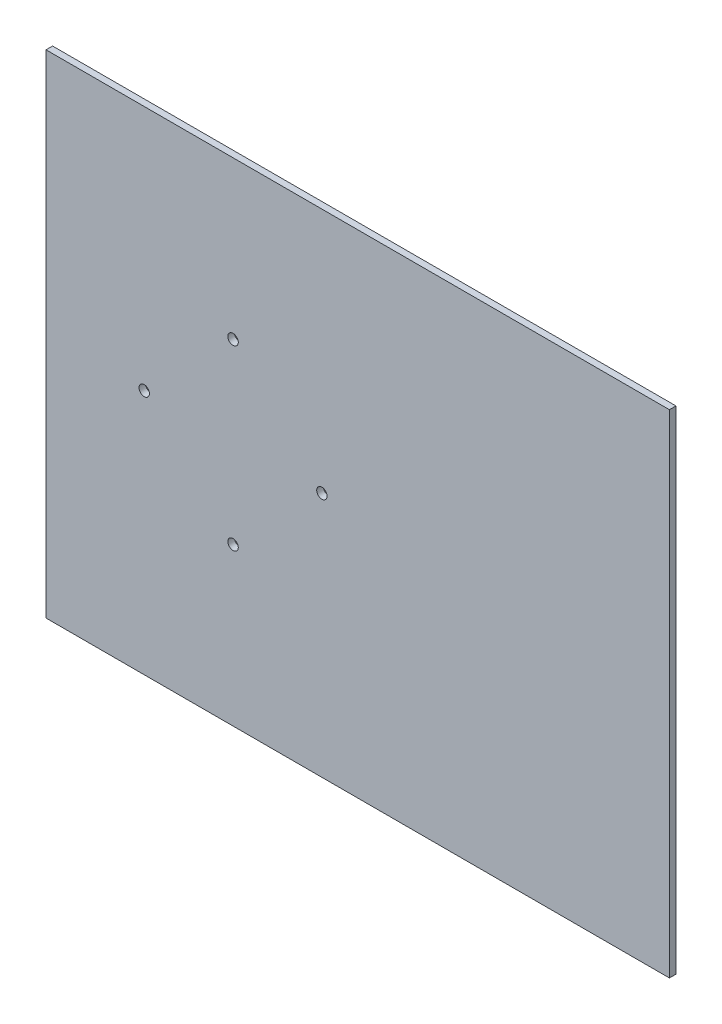
ISO-10303-21;
HEADER;
FILE_DESCRIPTION(('STEP AP214'),'2;1');
FILE_NAME('part.step','',(''),(''),'','','');
FILE_SCHEMA(('AUTOMOTIVE_DESIGN { 1 0 10303 214 1 1 1 1 }'));
ENDSEC;
DATA;
#1=APPLICATION_CONTEXT('core data for automotive mechanical design processes');
#2=APPLICATION_PROTOCOL_DEFINITION('international standard','automotive_design',2000,#1);
#3=PRODUCT_CONTEXT('',#1,'mechanical');
#4=PRODUCT('Part','Part','',(#3));
#5=PRODUCT_RELATED_PRODUCT_CATEGORY('part','',(#4));
#6=PRODUCT_DEFINITION_FORMATION('','',#4);
#7=PRODUCT_DEFINITION_CONTEXT('part definition',#1,'design');
#8=PRODUCT_DEFINITION('design','',#6,#7);
#9=PRODUCT_DEFINITION_SHAPE('','',#8);
#10=(LENGTH_UNIT() NAMED_UNIT(*) SI_UNIT(.MILLI.,.METRE.));
#11=(NAMED_UNIT(*) PLANE_ANGLE_UNIT() SI_UNIT($,.RADIAN.));
#12=(NAMED_UNIT(*) SI_UNIT($,.STERADIAN.) SOLID_ANGLE_UNIT());
#13=UNCERTAINTY_MEASURE_WITH_UNIT(LENGTH_MEASURE(1.E-05),#10,'distance_accuracy_value','');
#14=(GEOMETRIC_REPRESENTATION_CONTEXT(3) GLOBAL_UNCERTAINTY_ASSIGNED_CONTEXT((#13)) GLOBAL_UNIT_ASSIGNED_CONTEXT((#10,
#11,#12)) REPRESENTATION_CONTEXT('',''));
#15=CARTESIAN_POINT('',(0.,0.,0.));
#16=DIRECTION('',(0.,0.,1.));
#17=DIRECTION('',(1.,0.,0.));
#18=AXIS2_PLACEMENT_3D('',#15,#16,#17);
#19=CARTESIAN_POINT('',(-112.654675963061,52.9041761790173,4.));
#20=DIRECTION('',(0.,1.,0.));
#21=DIRECTION('',(0.,0.,1.));
#22=AXIS2_PLACEMENT_3D('',#19,#20,#21);
#23=PLANE('',#22);
#24=DIRECTION('',(1.,0.,0.));
#25=VECTOR('',#24,1.);
#26=CARTESIAN_POINT('',(-112.654675963061,52.9041761790173,0.));
#27=LINE('',#26,#25);
#28=CARTESIAN_POINT('',(-112.654675963061,52.9041761790173,0.));
#29=VERTEX_POINT('',#28);
#30=CARTESIAN_POINT('',(267.345324036939,52.9041761790173,0.));
#31=VERTEX_POINT('',#30);
#32=EDGE_CURVE('E99',#29,#31,#27,.T.);
#33=ORIENTED_EDGE('',*,*,#32,.F.);
#34=DIRECTION('',(0.,0.,-1.));
#35=VECTOR('',#34,1.);
#36=CARTESIAN_POINT('',(-112.654675963061,52.9041761790173,4.));
#37=LINE('',#36,#35);
#38=CARTESIAN_POINT('',(-112.654675963061,52.9041761790173,4.));
#39=VERTEX_POINT('',#38);
#40=EDGE_CURVE('E11',#39,#29,#37,.T.);
#41=ORIENTED_EDGE('',*,*,#40,.F.);
#42=DIRECTION('',(1.,0.,0.));
#43=VECTOR('',#42,1.);
#44=CARTESIAN_POINT('',(-112.654675963061,52.9041761790173,4.));
#45=LINE('',#44,#43);
#46=CARTESIAN_POINT('',(267.345324036939,52.9041761790173,4.));
#47=VERTEX_POINT('',#46);
#48=EDGE_CURVE('E93',#39,#47,#45,.T.);
#49=ORIENTED_EDGE('',*,*,#48,.T.);
#50=DIRECTION('',(0.,0.,-1.));
#51=VECTOR('',#50,1.);
#52=CARTESIAN_POINT('',(267.345324036939,52.9041761790173,4.));
#53=LINE('',#52,#51);
#54=EDGE_CURVE('E36',#47,#31,#53,.T.);
#55=ORIENTED_EDGE('',*,*,#54,.T.);
#56=EDGE_LOOP('',(#33,#41,#49,#55));
#57=FACE_BOUND('',#56,.T.);
#58=ADVANCED_FACE('F33',(#57),#23,.T.);
#59=CARTESIAN_POINT('',(-112.654675963061,52.9041761790173,4.));
#60=DIRECTION('',(1.,0.,0.));
#61=DIRECTION('',(0.,1.,0.));
#62=AXIS2_PLACEMENT_3D('',#59,#60,#61);
#63=PLANE('',#62);
#64=DIRECTION('',(0.,-1.,0.));
#65=VECTOR('',#64,1.);
#66=CARTESIAN_POINT('',(-112.654675963061,52.9041761790173,0.));
#67=LINE('',#66,#65);
#68=CARTESIAN_POINT('',(-112.654675963061,-247.095823820983,0.));
#69=VERTEX_POINT('',#68);
#70=EDGE_CURVE('E66',#29,#69,#67,.T.);
#71=ORIENTED_EDGE('',*,*,#70,.T.);
#72=DIRECTION('',(0.,0.,-1.));
#73=VECTOR('',#72,1.);
#74=CARTESIAN_POINT('',(-112.654675963061,-247.095823820983,4.));
#75=LINE('',#74,#73);
#76=CARTESIAN_POINT('',(-112.654675963061,-247.095823820983,4.));
#77=VERTEX_POINT('',#76);
#78=EDGE_CURVE('E42',#77,#69,#75,.T.);
#79=ORIENTED_EDGE('',*,*,#78,.F.);
#80=DIRECTION('',(0.,-1.,0.));
#81=VECTOR('',#80,1.);
#82=CARTESIAN_POINT('',(-112.654675963061,52.9041761790173,4.));
#83=LINE('',#82,#81);
#84=EDGE_CURVE('E83',#39,#77,#83,.T.);
#85=ORIENTED_EDGE('',*,*,#84,.F.);
#86=ORIENTED_EDGE('',*,*,#40,.T.);
#87=EDGE_LOOP('',(#71,#79,#85,#86));
#88=FACE_BOUND('',#87,.T.);
#89=ADVANCED_FACE('F110',(#88),#63,.F.);
#90=CARTESIAN_POINT('',(-112.654675963061,-247.095823820983,4.));
#91=DIRECTION('',(0.,1.,0.));
#92=DIRECTION('',(0.,0.,1.));
#93=AXIS2_PLACEMENT_3D('',#90,#91,#92);
#94=PLANE('',#93);
#95=DIRECTION('',(1.,0.,0.));
#96=VECTOR('',#95,1.);
#97=CARTESIAN_POINT('',(-112.654675963061,-247.095823820983,0.));
#98=LINE('',#97,#96);
#99=CARTESIAN_POINT('',(267.345324036939,-247.095823820983,0.));
#100=VERTEX_POINT('',#99);
#101=EDGE_CURVE('E90',#69,#100,#98,.T.);
#102=ORIENTED_EDGE('',*,*,#101,.T.);
#103=DIRECTION('',(0.,0.,-1.));
#104=VECTOR('',#103,1.);
#105=CARTESIAN_POINT('',(267.345324036939,-247.095823820983,4.));
#106=LINE('',#105,#104);
#107=CARTESIAN_POINT('',(267.345324036939,-247.095823820983,4.));
#108=VERTEX_POINT('',#107);
#109=EDGE_CURVE('E87',#108,#100,#106,.T.);
#110=ORIENTED_EDGE('',*,*,#109,.F.);
#111=DIRECTION('',(1.,0.,0.));
#112=VECTOR('',#111,1.);
#113=CARTESIAN_POINT('',(-112.654675963061,-247.095823820983,4.));
#114=LINE('',#113,#112);
#115=EDGE_CURVE('E78',#77,#108,#114,.T.);
#116=ORIENTED_EDGE('',*,*,#115,.F.);
#117=ORIENTED_EDGE('',*,*,#78,.T.);
#118=EDGE_LOOP('',(#102,#110,#116,#117));
#119=FACE_BOUND('',#118,.T.);
#120=ADVANCED_FACE('F88',(#119),#94,.F.);
#121=CARTESIAN_POINT('',(267.345324036939,52.9041761790173,4.));
#122=DIRECTION('',(1.,0.,0.));
#123=DIRECTION('',(0.,0.,-1.));
#124=AXIS2_PLACEMENT_3D('',#121,#122,#123);
#125=PLANE('',#124);
#126=DIRECTION('',(0.,-1.,0.));
#127=VECTOR('',#126,1.);
#128=CARTESIAN_POINT('',(267.345324036939,52.9041761790173,0.));
#129=LINE('',#128,#127);
#130=EDGE_CURVE('E102',#31,#100,#129,.T.);
#131=ORIENTED_EDGE('',*,*,#130,.F.);
#132=ORIENTED_EDGE('',*,*,#54,.F.);
#133=DIRECTION('',(0.,-1.,0.));
#134=VECTOR('',#133,1.);
#135=CARTESIAN_POINT('',(267.345324036939,52.9041761790173,4.));
#136=LINE('',#135,#134);
#137=EDGE_CURVE('E82',#47,#108,#136,.T.);
#138=ORIENTED_EDGE('',*,*,#137,.T.);
#139=ORIENTED_EDGE('',*,*,#109,.T.);
#140=EDGE_LOOP('',(#131,#132,#138,#139));
#141=FACE_BOUND('',#140,.T.);
#142=ADVANCED_FACE('F92',(#141),#125,.T.);
#143=CARTESIAN_POINT('',(0.,0.,4.));
#144=DIRECTION('',(0.,0.,-1.));
#145=DIRECTION('',(-1.,0.,0.));
#146=AXIS2_PLACEMENT_3D('',#143,#144,#145);
#147=PLANE('',#146);
#148=CARTESIAN_POINT('',(-52.8046759630605,-97.0958238209828,4.));
#149=DIRECTION('',(0.,0.,1.));
#150=DIRECTION('',(0.,1.,0.));
#151=AXIS2_PLACEMENT_3D('',#148,#149,#150);
#152=ELLIPSE('',#151,3.19999999999999,3.15);
#153=CARTESIAN_POINT('',(-52.8046759630605,-93.8958238209828,4.));
#154=VERTEX_POINT('',#153);
#155=EDGE_CURVE('E164',#154,#154,#152,.T.);
#156=ORIENTED_EDGE('',*,*,#155,.F.);
#157=EDGE_LOOP('',(#156));
#158=FACE_BOUND('',#157,.T.);
#159=CARTESIAN_POINT('',(1.34532403693979,-151.245823820983,4.));
#160=DIRECTION('',(0.,0.,1.));
#161=DIRECTION('',(-1.,0.,0.));
#162=AXIS2_PLACEMENT_3D('',#159,#160,#161);
#163=ELLIPSE('',#162,3.2,3.15000000000001);
#164=CARTESIAN_POINT('',(-1.85467596306021,-151.245823820983,4.));
#165=VERTEX_POINT('',#164);
#166=EDGE_CURVE('E157',#165,#165,#163,.T.);
#167=ORIENTED_EDGE('',*,*,#166,.F.);
#168=EDGE_LOOP('',(#167));
#169=FACE_BOUND('',#168,.T.);
#170=CARTESIAN_POINT('',(55.4953240369395,-97.0958238209822,4.));
#171=DIRECTION('',(0.,0.,1.));
#172=DIRECTION('',(0.,-1.,0.));
#173=AXIS2_PLACEMENT_3D('',#170,#171,#172);
#174=ELLIPSE('',#173,3.20000000000001,3.15);
#175=CARTESIAN_POINT('',(55.4953240369395,-100.295823820982,4.));
#176=VERTEX_POINT('',#175);
#177=EDGE_CURVE('E145',#176,#176,#174,.T.);
#178=ORIENTED_EDGE('',*,*,#177,.F.);
#179=EDGE_LOOP('',(#178));
#180=FACE_BOUND('',#179,.T.);
#181=CARTESIAN_POINT('',(1.34532403693874,-42.9458238209827,4.));
#182=DIRECTION('',(0.,0.,1.));
#183=DIRECTION('',(1.,0.,0.));
#184=AXIS2_PLACEMENT_3D('',#181,#182,#183);
#185=ELLIPSE('',#184,3.2,3.15);
#186=CARTESIAN_POINT('',(4.54532403693874,-42.9458238209827,4.));
#187=VERTEX_POINT('',#186);
#188=EDGE_CURVE('E144',#187,#187,#185,.T.);
#189=ORIENTED_EDGE('',*,*,#188,.F.);
#190=EDGE_LOOP('',(#189));
#191=FACE_BOUND('',#190,.T.);
#192=ORIENTED_EDGE('',*,*,#48,.F.);
#193=ORIENTED_EDGE('',*,*,#84,.T.);
#194=ORIENTED_EDGE('',*,*,#115,.T.);
#195=ORIENTED_EDGE('',*,*,#137,.F.);
#196=EDGE_LOOP('',(#192,#193,#194,#195));
#197=FACE_BOUND('',#196,.T.);
#198=ADVANCED_FACE('F81',(#158,#169,#180,#191,#197),#147,.F.);
#199=CARTESIAN_POINT('',(0.,0.,0.));
#200=DIRECTION('',(0.,0.,-1.));
#201=DIRECTION('',(-1.,0.,0.));
#202=AXIS2_PLACEMENT_3D('',#199,#200,#201);
#203=PLANE('',#202);
#204=CARTESIAN_POINT('',(-52.8046759630605,-97.0958238209828,0.));
#205=DIRECTION('',(0.,0.,1.));
#206=DIRECTION('',(0.,1.,0.));
#207=AXIS2_PLACEMENT_3D('',#204,#205,#206);
#208=ELLIPSE('',#207,3.19999999999999,3.15);
#209=CARTESIAN_POINT('',(-52.8046759630605,-93.8958238209828,0.));
#210=VERTEX_POINT('',#209);
#211=EDGE_CURVE('E160',#210,#210,#208,.T.);
#212=ORIENTED_EDGE('',*,*,#211,.T.);
#213=EDGE_LOOP('',(#212));
#214=FACE_BOUND('',#213,.T.);
#215=CARTESIAN_POINT('',(1.34532403693979,-151.245823820983,0.));
#216=DIRECTION('',(0.,0.,1.));
#217=DIRECTION('',(-1.,0.,0.));
#218=AXIS2_PLACEMENT_3D('',#215,#216,#217);
#219=ELLIPSE('',#218,3.2,3.15000000000001);
#220=CARTESIAN_POINT('',(-1.85467596306021,-151.245823820983,0.));
#221=VERTEX_POINT('',#220);
#222=EDGE_CURVE('E154',#221,#221,#219,.T.);
#223=ORIENTED_EDGE('',*,*,#222,.T.);
#224=EDGE_LOOP('',(#223));
#225=FACE_BOUND('',#224,.T.);
#226=CARTESIAN_POINT('',(55.4953240369395,-97.0958238209822,0.));
#227=DIRECTION('',(0.,0.,1.));
#228=DIRECTION('',(0.,-1.,0.));
#229=AXIS2_PLACEMENT_3D('',#226,#227,#228);
#230=ELLIPSE('',#229,3.20000000000001,3.15);
#231=CARTESIAN_POINT('',(55.4953240369395,-100.295823820982,0.));
#232=VERTEX_POINT('',#231);
#233=EDGE_CURVE('E147',#232,#232,#230,.T.);
#234=ORIENTED_EDGE('',*,*,#233,.T.);
#235=EDGE_LOOP('',(#234));
#236=FACE_BOUND('',#235,.T.);
#237=CARTESIAN_POINT('',(1.34532403693874,-42.9458238209827,0.));
#238=DIRECTION('',(0.,0.,1.));
#239=DIRECTION('',(1.,0.,0.));
#240=AXIS2_PLACEMENT_3D('',#237,#238,#239);
#241=ELLIPSE('',#240,3.2,3.15);
#242=CARTESIAN_POINT('',(4.54532403693874,-42.9458238209827,0.));
#243=VERTEX_POINT('',#242);
#244=EDGE_CURVE('E103',#243,#243,#241,.T.);
#245=ORIENTED_EDGE('',*,*,#244,.T.);
#246=EDGE_LOOP('',(#245));
#247=FACE_BOUND('',#246,.T.);
#248=ORIENTED_EDGE('',*,*,#32,.T.);
#249=ORIENTED_EDGE('',*,*,#130,.T.);
#250=ORIENTED_EDGE('',*,*,#101,.F.);
#251=ORIENTED_EDGE('',*,*,#70,.F.);
#252=EDGE_LOOP('',(#248,#249,#250,#251));
#253=FACE_BOUND('',#252,.T.);
#254=ADVANCED_FACE('F108',(#214,#225,#236,#247,#253),#203,.T.);
#255=DIRECTION('',(0.,0.,1.));
#256=VECTOR('',#255,1.);
#257=SURFACE_OF_LINEAR_EXTRUSION('',#241,#256);
#258=ORIENTED_EDGE('',*,*,#244,.F.);
#259=EDGE_LOOP('',(#258));
#260=FACE_BOUND('',#259,.T.);
#261=ORIENTED_EDGE('',*,*,#188,.T.);
#262=EDGE_LOOP('',(#261));
#263=FACE_BOUND('',#262,.T.);
#264=ADVANCED_FACE('F129',(#260,#263),#257,.F.);
#265=DIRECTION('',(0.,0.,1.));
#266=VECTOR('',#265,1.);
#267=SURFACE_OF_LINEAR_EXTRUSION('',#230,#266);
#268=ORIENTED_EDGE('',*,*,#233,.F.);
#269=EDGE_LOOP('',(#268));
#270=FACE_BOUND('',#269,.T.);
#271=ORIENTED_EDGE('',*,*,#177,.T.);
#272=EDGE_LOOP('',(#271));
#273=FACE_BOUND('',#272,.T.);
#274=ADVANCED_FACE('F137',(#270,#273),#267,.F.);
#275=DIRECTION('',(0.,0.,1.));
#276=VECTOR('',#275,1.);
#277=SURFACE_OF_LINEAR_EXTRUSION('',#219,#276);
#278=ORIENTED_EDGE('',*,*,#222,.F.);
#279=EDGE_LOOP('',(#278));
#280=FACE_BOUND('',#279,.T.);
#281=ORIENTED_EDGE('',*,*,#166,.T.);
#282=EDGE_LOOP('',(#281));
#283=FACE_BOUND('',#282,.T.);
#284=ADVANCED_FACE('F166',(#280,#283),#277,.F.);
#285=DIRECTION('',(0.,0.,1.));
#286=VECTOR('',#285,1.);
#287=SURFACE_OF_LINEAR_EXTRUSION('',#208,#286);
#288=ORIENTED_EDGE('',*,*,#211,.F.);
#289=EDGE_LOOP('',(#288));
#290=FACE_BOUND('',#289,.T.);
#291=ORIENTED_EDGE('',*,*,#155,.T.);
#292=EDGE_LOOP('',(#291));
#293=FACE_BOUND('',#292,.T.);
#294=ADVANCED_FACE('F169',(#290,#293),#287,.F.);
#295=CLOSED_SHELL('',(#58,#89,#120,#142,#198,#254,#264,#274,#284,#294));
#296=MANIFOLD_SOLID_BREP('B2',#295);
#297=ADVANCED_BREP_SHAPE_REPRESENTATION('',(#18,#296),#14);
#298=SHAPE_DEFINITION_REPRESENTATION(#9,#297);
ENDSEC;
END-ISO-10303-21;
